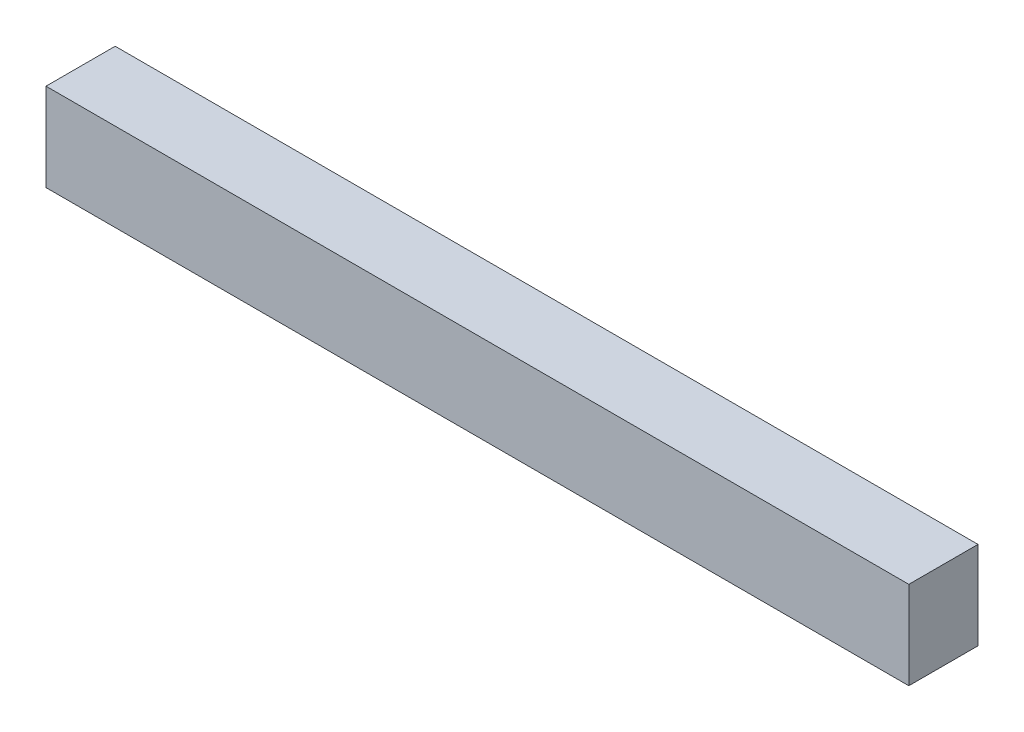
ISO-10303-21;
HEADER;
FILE_DESCRIPTION(('STEP AP214'),'2;1');
FILE_NAME('part.step','',(''),(''),'','','');
FILE_SCHEMA(('AUTOMOTIVE_DESIGN { 1 0 10303 214 1 1 1 1 }'));
ENDSEC;
DATA;
#1=APPLICATION_CONTEXT('core data for automotive mechanical design processes');
#2=APPLICATION_PROTOCOL_DEFINITION('international standard','automotive_design',2000,#1);
#3=PRODUCT_CONTEXT('',#1,'mechanical');
#4=PRODUCT('Part','Part','',(#3));
#5=PRODUCT_RELATED_PRODUCT_CATEGORY('part','',(#4));
#6=PRODUCT_DEFINITION_FORMATION('','',#4);
#7=PRODUCT_DEFINITION_CONTEXT('part definition',#1,'design');
#8=PRODUCT_DEFINITION('design','',#6,#7);
#9=PRODUCT_DEFINITION_SHAPE('','',#8);
#10=(LENGTH_UNIT() NAMED_UNIT(*) SI_UNIT(.MILLI.,.METRE.));
#11=(NAMED_UNIT(*) PLANE_ANGLE_UNIT() SI_UNIT($,.RADIAN.));
#12=(NAMED_UNIT(*) SI_UNIT($,.STERADIAN.) SOLID_ANGLE_UNIT());
#13=UNCERTAINTY_MEASURE_WITH_UNIT(LENGTH_MEASURE(1.E-05),#10,'distance_accuracy_value','');
#14=(GEOMETRIC_REPRESENTATION_CONTEXT(3) GLOBAL_UNCERTAINTY_ASSIGNED_CONTEXT((#13)) GLOBAL_UNIT_ASSIGNED_CONTEXT((#10,
#11,#12)) REPRESENTATION_CONTEXT('',''));
#15=CARTESIAN_POINT('',(0.,0.,0.));
#16=DIRECTION('',(0.,0.,1.));
#17=DIRECTION('',(1.,0.,0.));
#18=AXIS2_PLACEMENT_3D('',#15,#16,#17);
#19=CARTESIAN_POINT('',(0.,7.62,0.));
#20=DIRECTION('',(1.,0.,0.));
#21=DIRECTION('',(0.,0.,-1.));
#22=AXIS2_PLACEMENT_3D('',#19,#20,#21);
#23=PLANE('',#22);
#24=DIRECTION('',(0.,0.,1.));
#25=VECTOR('',#24,1.);
#26=CARTESIAN_POINT('',(0.,0.,0.));
#27=LINE('',#26,#25);
#28=CARTESIAN_POINT('',(0.,0.,-6.));
#29=VERTEX_POINT('',#28);
#30=CARTESIAN_POINT('',(0.,0.,0.));
#31=VERTEX_POINT('',#30);
#32=EDGE_CURVE('E100',#29,#31,#27,.T.);
#33=ORIENTED_EDGE('',*,*,#32,.T.);
#34=DIRECTION('',(0.,-1.,0.));
#35=VECTOR('',#34,1.);
#36=CARTESIAN_POINT('',(0.,7.62,0.));
#37=LINE('',#36,#35);
#38=CARTESIAN_POINT('',(0.,7.62,0.));
#39=VERTEX_POINT('',#38);
#40=EDGE_CURVE('E11',#39,#31,#37,.T.);
#41=ORIENTED_EDGE('',*,*,#40,.F.);
#42=DIRECTION('',(0.,0.,1.));
#43=VECTOR('',#42,1.);
#44=CARTESIAN_POINT('',(0.,7.62,0.));
#45=LINE('',#44,#43);
#46=CARTESIAN_POINT('',(0.,7.62,-6.));
#47=VERTEX_POINT('',#46);
#48=EDGE_CURVE('E88',#47,#39,#45,.T.);
#49=ORIENTED_EDGE('',*,*,#48,.F.);
#50=DIRECTION('',(0.,-1.,0.));
#51=VECTOR('',#50,1.);
#52=CARTESIAN_POINT('',(0.,7.62,-6.));
#53=LINE('',#52,#51);
#54=EDGE_CURVE('E96',#47,#29,#53,.T.);
#55=ORIENTED_EDGE('',*,*,#54,.T.);
#56=EDGE_LOOP('',(#33,#41,#49,#55));
#57=FACE_BOUND('',#56,.T.);
#58=ADVANCED_FACE('F37',(#57),#23,.F.);
#59=CARTESIAN_POINT('',(0.,7.62,0.));
#60=DIRECTION('',(0.,0.,-1.));
#61=DIRECTION('',(-1.,0.,0.));
#62=AXIS2_PLACEMENT_3D('',#59,#60,#61);
#63=PLANE('',#62);
#64=DIRECTION('',(1.,0.,0.));
#65=VECTOR('',#64,1.);
#66=CARTESIAN_POINT('',(0.,0.,0.));
#67=LINE('',#66,#65);
#68=CARTESIAN_POINT('',(74.84,0.,0.));
#69=VERTEX_POINT('',#68);
#70=EDGE_CURVE('E92',#31,#69,#67,.T.);
#71=ORIENTED_EDGE('',*,*,#70,.T.);
#72=DIRECTION('',(0.,-1.,0.));
#73=VECTOR('',#72,1.);
#74=CARTESIAN_POINT('',(74.84,7.62,0.));
#75=LINE('',#74,#73);
#76=CARTESIAN_POINT('',(74.84,7.62,0.));
#77=VERTEX_POINT('',#76);
#78=EDGE_CURVE('E45',#77,#69,#75,.T.);
#79=ORIENTED_EDGE('',*,*,#78,.F.);
#80=DIRECTION('',(1.,0.,0.));
#81=VECTOR('',#80,1.);
#82=CARTESIAN_POINT('',(0.,7.62,0.));
#83=LINE('',#82,#81);
#84=EDGE_CURVE('E83',#39,#77,#83,.T.);
#85=ORIENTED_EDGE('',*,*,#84,.F.);
#86=ORIENTED_EDGE('',*,*,#40,.T.);
#87=EDGE_LOOP('',(#71,#79,#85,#86));
#88=FACE_BOUND('',#87,.T.);
#89=ADVANCED_FACE('F91',(#88),#63,.F.);
#90=CARTESIAN_POINT('',(74.84,7.62,0.));
#91=DIRECTION('',(-1.,0.,0.));
#92=DIRECTION('',(0.,0.,1.));
#93=AXIS2_PLACEMENT_3D('',#90,#91,#92);
#94=PLANE('',#93);
#95=DIRECTION('',(0.,0.,-1.));
#96=VECTOR('',#95,1.);
#97=CARTESIAN_POINT('',(74.84,0.,0.));
#98=LINE('',#97,#96);
#99=CARTESIAN_POINT('',(74.84,0.,-6.));
#100=VERTEX_POINT('',#99);
#101=EDGE_CURVE('E70',#69,#100,#98,.T.);
#102=ORIENTED_EDGE('',*,*,#101,.T.);
#103=DIRECTION('',(0.,-1.,0.));
#104=VECTOR('',#103,1.);
#105=CARTESIAN_POINT('',(74.84,7.62,-6.));
#106=LINE('',#105,#104);
#107=CARTESIAN_POINT('',(74.84,7.62,-6.));
#108=VERTEX_POINT('',#107);
#109=EDGE_CURVE('E93',#108,#100,#106,.T.);
#110=ORIENTED_EDGE('',*,*,#109,.F.);
#111=DIRECTION('',(0.,0.,-1.));
#112=VECTOR('',#111,1.);
#113=CARTESIAN_POINT('',(74.84,7.62,0.));
#114=LINE('',#113,#112);
#115=EDGE_CURVE('E86',#77,#108,#114,.T.);
#116=ORIENTED_EDGE('',*,*,#115,.F.);
#117=ORIENTED_EDGE('',*,*,#78,.T.);
#118=EDGE_LOOP('',(#102,#110,#116,#117));
#119=FACE_BOUND('',#118,.T.);
#120=ADVANCED_FACE('F94',(#119),#94,.F.);
#121=CARTESIAN_POINT('',(0.,7.62,-6.));
#122=DIRECTION('',(0.,0.,1.));
#123=DIRECTION('',(1.,0.,0.));
#124=AXIS2_PLACEMENT_3D('',#121,#122,#123);
#125=PLANE('',#124);
#126=DIRECTION('',(-1.,0.,0.));
#127=VECTOR('',#126,1.);
#128=CARTESIAN_POINT('',(0.,0.,-6.));
#129=LINE('',#128,#127);
#130=EDGE_CURVE('E76',#100,#29,#129,.T.);
#131=ORIENTED_EDGE('',*,*,#130,.T.);
#132=ORIENTED_EDGE('',*,*,#54,.F.);
#133=DIRECTION('',(-1.,0.,0.));
#134=VECTOR('',#133,1.);
#135=CARTESIAN_POINT('',(0.,7.62,-6.));
#136=LINE('',#135,#134);
#137=EDGE_CURVE('E53',#108,#47,#136,.T.);
#138=ORIENTED_EDGE('',*,*,#137,.F.);
#139=ORIENTED_EDGE('',*,*,#109,.T.);
#140=EDGE_LOOP('',(#131,#132,#138,#139));
#141=FACE_BOUND('',#140,.T.);
#142=ADVANCED_FACE('F107',(#141),#125,.F.);
#143=CARTESIAN_POINT('',(0.,7.62,0.));
#144=DIRECTION('',(0.,-1.,0.));
#145=DIRECTION('',(0.,0.,-1.));
#146=AXIS2_PLACEMENT_3D('',#143,#144,#145);
#147=PLANE('',#146);
#148=ORIENTED_EDGE('',*,*,#48,.T.);
#149=ORIENTED_EDGE('',*,*,#84,.T.);
#150=ORIENTED_EDGE('',*,*,#115,.T.);
#151=ORIENTED_EDGE('',*,*,#137,.T.);
#152=EDGE_LOOP('',(#148,#149,#150,#151));
#153=FACE_BOUND('',#152,.T.);
#154=ADVANCED_FACE('F84',(#153),#147,.F.);
#155=CARTESIAN_POINT('',(0.,0.,0.));
#156=DIRECTION('',(0.,-1.,0.));
#157=DIRECTION('',(0.,0.,-1.));
#158=AXIS2_PLACEMENT_3D('',#155,#156,#157);
#159=PLANE('',#158);
#160=ORIENTED_EDGE('',*,*,#32,.F.);
#161=ORIENTED_EDGE('',*,*,#130,.F.);
#162=ORIENTED_EDGE('',*,*,#101,.F.);
#163=ORIENTED_EDGE('',*,*,#70,.F.);
#164=EDGE_LOOP('',(#160,#161,#162,#163));
#165=FACE_BOUND('',#164,.T.);
#166=ADVANCED_FACE('F110',(#165),#159,.T.);
#167=CLOSED_SHELL('',(#58,#89,#120,#142,#154,#166));
#168=MANIFOLD_SOLID_BREP('B2',#167);
#169=ADVANCED_BREP_SHAPE_REPRESENTATION('',(#18,#168),#14);
#170=SHAPE_DEFINITION_REPRESENTATION(#9,#169);
ENDSEC;
END-ISO-10303-21;
